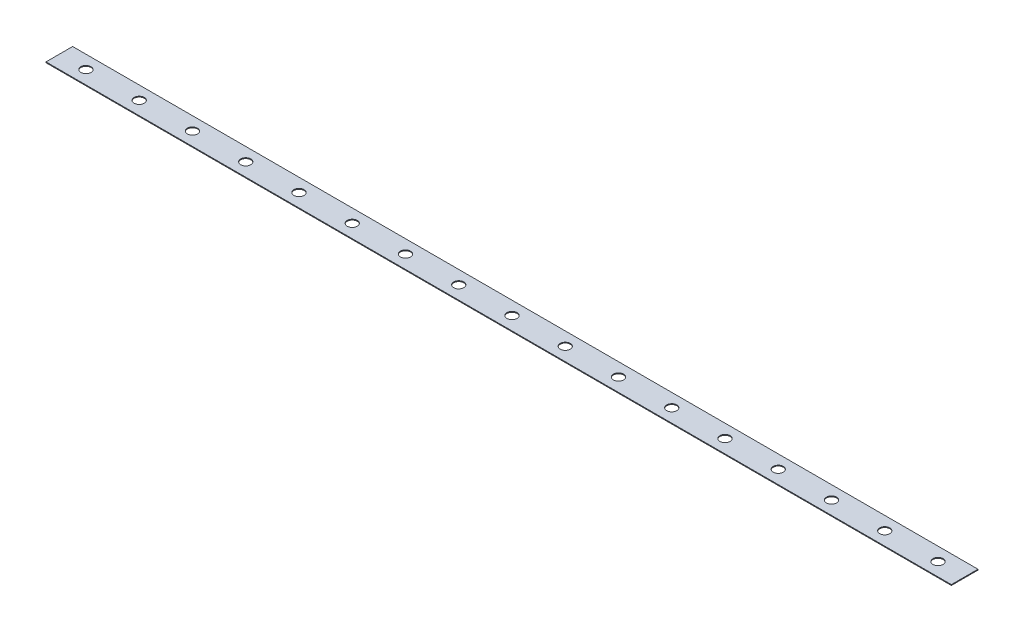
ISO-10303-21;
HEADER;
FILE_DESCRIPTION(('STEP AP214'),'2;1');
FILE_NAME('part.step','',(''),(''),'','','');
FILE_SCHEMA(('AUTOMOTIVE_DESIGN { 1 0 10303 214 1 1 1 1 }'));
ENDSEC;
DATA;
#1=APPLICATION_CONTEXT('core data for automotive mechanical design processes');
#2=APPLICATION_PROTOCOL_DEFINITION('international standard','automotive_design',2000,#1);
#3=PRODUCT_CONTEXT('',#1,'mechanical');
#4=PRODUCT('Part','Part','',(#3));
#5=PRODUCT_RELATED_PRODUCT_CATEGORY('part','',(#4));
#6=PRODUCT_DEFINITION_FORMATION('','',#4);
#7=PRODUCT_DEFINITION_CONTEXT('part definition',#1,'design');
#8=PRODUCT_DEFINITION('design','',#6,#7);
#9=PRODUCT_DEFINITION_SHAPE('','',#8);
#10=(LENGTH_UNIT() NAMED_UNIT(*) SI_UNIT(.MILLI.,.METRE.));
#11=(NAMED_UNIT(*) PLANE_ANGLE_UNIT() SI_UNIT($,.RADIAN.));
#12=(NAMED_UNIT(*) SI_UNIT($,.STERADIAN.) SOLID_ANGLE_UNIT());
#13=UNCERTAINTY_MEASURE_WITH_UNIT(LENGTH_MEASURE(1.E-05),#10,'distance_accuracy_value','');
#14=(GEOMETRIC_REPRESENTATION_CONTEXT(3) GLOBAL_UNCERTAINTY_ASSIGNED_CONTEXT((#13)) GLOBAL_UNIT_ASSIGNED_CONTEXT((#10,
#11,#12)) REPRESENTATION_CONTEXT('',''));
#15=CARTESIAN_POINT('',(0.,0.,0.));
#16=DIRECTION('',(0.,0.,1.));
#17=DIRECTION('',(1.,0.,0.));
#18=AXIS2_PLACEMENT_3D('',#15,#16,#17);
#19=CARTESIAN_POINT('',(215.9,0.381,-6.35));
#20=DIRECTION('',(-1.,0.,0.));
#21=DIRECTION('',(0.,0.,1.));
#22=AXIS2_PLACEMENT_3D('',#19,#20,#21);
#23=PLANE('',#22);
#24=DIRECTION('',(0.,0.,-1.));
#25=VECTOR('',#24,1.);
#26=CARTESIAN_POINT('',(215.9,0.,-6.35));
#27=LINE('',#26,#25);
#28=CARTESIAN_POINT('',(215.9,0.,6.35));
#29=VERTEX_POINT('',#28);
#30=CARTESIAN_POINT('',(215.9,0.,-6.35));
#31=VERTEX_POINT('',#30);
#32=EDGE_CURVE('E98',#29,#31,#27,.T.);
#33=ORIENTED_EDGE('',*,*,#32,.T.);
#34=DIRECTION('',(0.,-1.,0.));
#35=VECTOR('',#34,1.);
#36=CARTESIAN_POINT('',(215.9,0.381,-6.35));
#37=LINE('',#36,#35);
#38=CARTESIAN_POINT('',(215.9,0.381,-6.35));
#39=VERTEX_POINT('',#38);
#40=EDGE_CURVE('E11',#39,#31,#37,.T.);
#41=ORIENTED_EDGE('',*,*,#40,.F.);
#42=DIRECTION('',(0.,0.,-1.));
#43=VECTOR('',#42,1.);
#44=CARTESIAN_POINT('',(215.9,0.381,-6.35));
#45=LINE('',#44,#43);
#46=CARTESIAN_POINT('',(215.9,0.381,6.35));
#47=VERTEX_POINT('',#46);
#48=EDGE_CURVE('E86',#47,#39,#45,.T.);
#49=ORIENTED_EDGE('',*,*,#48,.F.);
#50=DIRECTION('',(0.,-1.,0.));
#51=VECTOR('',#50,1.);
#52=CARTESIAN_POINT('',(215.9,0.381,6.35));
#53=LINE('',#52,#51);
#54=EDGE_CURVE('E94',#47,#29,#53,.T.);
#55=ORIENTED_EDGE('',*,*,#54,.T.);
#56=EDGE_LOOP('',(#33,#41,#49,#55));
#57=FACE_BOUND('',#56,.T.);
#58=ADVANCED_FACE('F35',(#57),#23,.F.);
#59=CARTESIAN_POINT('',(-215.9,0.381,-6.35));
#60=DIRECTION('',(0.,0.,1.));
#61=DIRECTION('',(1.,0.,0.));
#62=AXIS2_PLACEMENT_3D('',#59,#60,#61);
#63=PLANE('',#62);
#64=DIRECTION('',(-1.,0.,0.));
#65=VECTOR('',#64,1.);
#66=CARTESIAN_POINT('',(-215.9,0.,-6.35));
#67=LINE('',#66,#65);
#68=CARTESIAN_POINT('',(-215.9,0.,-6.35));
#69=VERTEX_POINT('',#68);
#70=EDGE_CURVE('E90',#31,#69,#67,.T.);
#71=ORIENTED_EDGE('',*,*,#70,.T.);
#72=DIRECTION('',(0.,-1.,0.));
#73=VECTOR('',#72,1.);
#74=CARTESIAN_POINT('',(-215.9,0.381,-6.35));
#75=LINE('',#74,#73);
#76=CARTESIAN_POINT('',(-215.9,0.381,-6.35));
#77=VERTEX_POINT('',#76);
#78=EDGE_CURVE('E43',#77,#69,#75,.T.);
#79=ORIENTED_EDGE('',*,*,#78,.F.);
#80=DIRECTION('',(-1.,0.,0.));
#81=VECTOR('',#80,1.);
#82=CARTESIAN_POINT('',(-215.9,0.381,-6.35));
#83=LINE('',#82,#81);
#84=EDGE_CURVE('E81',#39,#77,#83,.T.);
#85=ORIENTED_EDGE('',*,*,#84,.F.);
#86=ORIENTED_EDGE('',*,*,#40,.T.);
#87=EDGE_LOOP('',(#71,#79,#85,#86));
#88=FACE_BOUND('',#87,.T.);
#89=ADVANCED_FACE('F89',(#88),#63,.F.);
#90=CARTESIAN_POINT('',(-215.9,0.381,-6.35));
#91=DIRECTION('',(1.,0.,0.));
#92=DIRECTION('',(0.,0.,-1.));
#93=AXIS2_PLACEMENT_3D('',#90,#91,#92);
#94=PLANE('',#93);
#95=DIRECTION('',(0.,0.,1.));
#96=VECTOR('',#95,1.);
#97=CARTESIAN_POINT('',(-215.9,0.,-6.35));
#98=LINE('',#97,#96);
#99=CARTESIAN_POINT('',(-215.9,0.,6.35));
#100=VERTEX_POINT('',#99);
#101=EDGE_CURVE('E68',#69,#100,#98,.T.);
#102=ORIENTED_EDGE('',*,*,#101,.T.);
#103=DIRECTION('',(0.,-1.,0.));
#104=VECTOR('',#103,1.);
#105=CARTESIAN_POINT('',(-215.9,0.381,6.35));
#106=LINE('',#105,#104);
#107=CARTESIAN_POINT('',(-215.9,0.381,6.35));
#108=VERTEX_POINT('',#107);
#109=EDGE_CURVE('E91',#108,#100,#106,.T.);
#110=ORIENTED_EDGE('',*,*,#109,.F.);
#111=DIRECTION('',(0.,0.,1.));
#112=VECTOR('',#111,1.);
#113=CARTESIAN_POINT('',(-215.9,0.381,-6.35));
#114=LINE('',#113,#112);
#115=EDGE_CURVE('E84',#77,#108,#114,.T.);
#116=ORIENTED_EDGE('',*,*,#115,.F.);
#117=ORIENTED_EDGE('',*,*,#78,.T.);
#118=EDGE_LOOP('',(#102,#110,#116,#117));
#119=FACE_BOUND('',#118,.T.);
#120=ADVANCED_FACE('F92',(#119),#94,.F.);
#121=CARTESIAN_POINT('',(-215.9,0.381,6.35));
#122=DIRECTION('',(0.,0.,-1.));
#123=DIRECTION('',(-1.,0.,0.));
#124=AXIS2_PLACEMENT_3D('',#121,#122,#123);
#125=PLANE('',#124);
#126=DIRECTION('',(1.,0.,0.));
#127=VECTOR('',#126,1.);
#128=CARTESIAN_POINT('',(-215.9,0.,6.35));
#129=LINE('',#128,#127);
#130=EDGE_CURVE('E74',#100,#29,#129,.T.);
#131=ORIENTED_EDGE('',*,*,#130,.T.);
#132=ORIENTED_EDGE('',*,*,#54,.F.);
#133=DIRECTION('',(1.,0.,0.));
#134=VECTOR('',#133,1.);
#135=CARTESIAN_POINT('',(-215.9,0.381,6.35));
#136=LINE('',#135,#134);
#137=EDGE_CURVE('E51',#108,#47,#136,.T.);
#138=ORIENTED_EDGE('',*,*,#137,.F.);
#139=ORIENTED_EDGE('',*,*,#109,.T.);
#140=EDGE_LOOP('',(#131,#132,#138,#139));
#141=FACE_BOUND('',#140,.T.);
#142=ADVANCED_FACE('F106',(#141),#125,.F.);
#143=CARTESIAN_POINT('',(0.,0.381,0.));
#144=DIRECTION('',(0.,1.,0.));
#145=DIRECTION('',(0.,0.,1.));
#146=AXIS2_PLACEMENT_3D('',#143,#144,#145);
#147=PLANE('',#146);
#148=CARTESIAN_POINT('',(203.2,0.381,0.));
#149=DIRECTION('',(0.,1.,0.));
#150=DIRECTION('',(0.,0.,1.));
#151=AXIS2_PLACEMENT_3D('',#148,#149,#150);
#152=CIRCLE('',#151,2.413);
#153=CARTESIAN_POINT('',(203.2,0.381,2.413));
#154=VERTEX_POINT('',#153);
#155=EDGE_CURVE('E208',#154,#154,#152,.T.);
#156=ORIENTED_EDGE('',*,*,#155,.F.);
#157=EDGE_LOOP('',(#156));
#158=FACE_BOUND('',#157,.T.);
#159=CARTESIAN_POINT('',(177.8,0.381,0.));
#160=DIRECTION('',(0.,1.,0.));
#161=DIRECTION('',(0.,0.,1.));
#162=AXIS2_PLACEMENT_3D('',#159,#160,#161);
#163=CIRCLE('',#162,2.413);
#164=CARTESIAN_POINT('',(177.8,0.381,2.413));
#165=VERTEX_POINT('',#164);
#166=EDGE_CURVE('E202',#165,#165,#163,.T.);
#167=ORIENTED_EDGE('',*,*,#166,.F.);
#168=EDGE_LOOP('',(#167));
#169=FACE_BOUND('',#168,.T.);
#170=CARTESIAN_POINT('',(152.4,0.381,0.));
#171=DIRECTION('',(0.,1.,0.));
#172=DIRECTION('',(0.,0.,1.));
#173=AXIS2_PLACEMENT_3D('',#170,#171,#172);
#174=CIRCLE('',#173,2.413);
#175=CARTESIAN_POINT('',(152.4,0.381,2.413));
#176=VERTEX_POINT('',#175);
#177=EDGE_CURVE('E196',#176,#176,#174,.T.);
#178=ORIENTED_EDGE('',*,*,#177,.F.);
#179=EDGE_LOOP('',(#178));
#180=FACE_BOUND('',#179,.T.);
#181=CARTESIAN_POINT('',(127.,0.381,0.));
#182=DIRECTION('',(0.,1.,0.));
#183=DIRECTION('',(0.,0.,1.));
#184=AXIS2_PLACEMENT_3D('',#181,#182,#183);
#185=CIRCLE('',#184,2.413);
#186=CARTESIAN_POINT('',(127.,0.381,2.413));
#187=VERTEX_POINT('',#186);
#188=EDGE_CURVE('E190',#187,#187,#185,.T.);
#189=ORIENTED_EDGE('',*,*,#188,.F.);
#190=EDGE_LOOP('',(#189));
#191=FACE_BOUND('',#190,.T.);
#192=CARTESIAN_POINT('',(101.6,0.381,0.));
#193=DIRECTION('',(0.,1.,0.));
#194=DIRECTION('',(0.,0.,1.));
#195=AXIS2_PLACEMENT_3D('',#192,#193,#194);
#196=CIRCLE('',#195,2.413);
#197=CARTESIAN_POINT('',(101.6,0.381,2.413));
#198=VERTEX_POINT('',#197);
#199=EDGE_CURVE('E184',#198,#198,#196,.T.);
#200=ORIENTED_EDGE('',*,*,#199,.F.);
#201=EDGE_LOOP('',(#200));
#202=FACE_BOUND('',#201,.T.);
#203=CARTESIAN_POINT('',(76.2,0.381,0.));
#204=DIRECTION('',(0.,1.,0.));
#205=DIRECTION('',(0.,0.,1.));
#206=AXIS2_PLACEMENT_3D('',#203,#204,#205);
#207=CIRCLE('',#206,2.413);
#208=CARTESIAN_POINT('',(76.2,0.381,2.413));
#209=VERTEX_POINT('',#208);
#210=EDGE_CURVE('E178',#209,#209,#207,.T.);
#211=ORIENTED_EDGE('',*,*,#210,.F.);
#212=EDGE_LOOP('',(#211));
#213=FACE_BOUND('',#212,.T.);
#214=CARTESIAN_POINT('',(50.8,0.381,0.));
#215=DIRECTION('',(0.,1.,0.));
#216=DIRECTION('',(0.,0.,1.));
#217=AXIS2_PLACEMENT_3D('',#214,#215,#216);
#218=CIRCLE('',#217,2.413);
#219=CARTESIAN_POINT('',(50.8,0.381,2.413));
#220=VERTEX_POINT('',#219);
#221=EDGE_CURVE('E172',#220,#220,#218,.T.);
#222=ORIENTED_EDGE('',*,*,#221,.F.);
#223=EDGE_LOOP('',(#222));
#224=FACE_BOUND('',#223,.T.);
#225=CARTESIAN_POINT('',(-203.2,0.381,1.24157076409262E-12));
#226=DIRECTION('',(0.,1.,0.));
#227=DIRECTION('',(0.,0.,1.));
#228=AXIS2_PLACEMENT_3D('',#225,#226,#227);
#229=CIRCLE('',#228,2.413);
#230=CARTESIAN_POINT('',(-203.2,0.381,2.41300000000124));
#231=VERTEX_POINT('',#230);
#232=EDGE_CURVE('E166',#231,#231,#229,.T.);
#233=ORIENTED_EDGE('',*,*,#232,.F.);
#234=EDGE_LOOP('',(#233));
#235=FACE_BOUND('',#234,.T.);
#236=CARTESIAN_POINT('',(-177.8,0.381,1.06420351207939E-12));
#237=DIRECTION('',(0.,1.,0.));
#238=DIRECTION('',(0.,0.,1.));
#239=AXIS2_PLACEMENT_3D('',#236,#237,#238);
#240=CIRCLE('',#239,2.413);
#241=CARTESIAN_POINT('',(-177.8,0.381,2.41300000000106));
#242=VERTEX_POINT('',#241);
#243=EDGE_CURVE('E160',#242,#242,#240,.T.);
#244=ORIENTED_EDGE('',*,*,#243,.F.);
#245=EDGE_LOOP('',(#244));
#246=FACE_BOUND('',#245,.T.);
#247=CARTESIAN_POINT('',(-152.4,0.381,8.86836260066156E-13));
#248=DIRECTION('',(0.,1.,0.));
#249=DIRECTION('',(0.,0.,1.));
#250=AXIS2_PLACEMENT_3D('',#247,#248,#249);
#251=CIRCLE('',#250,2.413);
#252=CARTESIAN_POINT('',(-152.4,0.381,2.41300000000088));
#253=VERTEX_POINT('',#252);
#254=EDGE_CURVE('E154',#253,#253,#251,.T.);
#255=ORIENTED_EDGE('',*,*,#254,.F.);
#256=EDGE_LOOP('',(#255));
#257=FACE_BOUND('',#256,.T.);
#258=CARTESIAN_POINT('',(-127.,0.381,7.09469008052925E-13));
#259=DIRECTION('',(0.,1.,0.));
#260=DIRECTION('',(0.,0.,1.));
#261=AXIS2_PLACEMENT_3D('',#258,#259,#260);
#262=CIRCLE('',#261,2.413);
#263=CARTESIAN_POINT('',(-127.,0.381,2.41300000000071));
#264=VERTEX_POINT('',#263);
#265=EDGE_CURVE('E148',#264,#264,#262,.T.);
#266=ORIENTED_EDGE('',*,*,#265,.F.);
#267=EDGE_LOOP('',(#266));
#268=FACE_BOUND('',#267,.T.);
#269=CARTESIAN_POINT('',(-101.6,0.381,5.32101756039693E-13));
#270=DIRECTION('',(0.,1.,0.));
#271=DIRECTION('',(0.,0.,1.));
#272=AXIS2_PLACEMENT_3D('',#269,#270,#271);
#273=CIRCLE('',#272,2.413);
#274=CARTESIAN_POINT('',(-101.6,0.381,2.41300000000053));
#275=VERTEX_POINT('',#274);
#276=EDGE_CURVE('E142',#275,#275,#273,.T.);
#277=ORIENTED_EDGE('',*,*,#276,.F.);
#278=EDGE_LOOP('',(#277));
#279=FACE_BOUND('',#278,.T.);
#280=CARTESIAN_POINT('',(-76.2,0.381,3.54734504026462E-13));
#281=DIRECTION('',(0.,1.,0.));
#282=DIRECTION('',(0.,0.,1.));
#283=AXIS2_PLACEMENT_3D('',#280,#281,#282);
#284=CIRCLE('',#283,2.413);
#285=CARTESIAN_POINT('',(-76.2,0.381,2.41300000000035));
#286=VERTEX_POINT('',#285);
#287=EDGE_CURVE('E136',#286,#286,#284,.T.);
#288=ORIENTED_EDGE('',*,*,#287,.F.);
#289=EDGE_LOOP('',(#288));
#290=FACE_BOUND('',#289,.T.);
#291=CARTESIAN_POINT('',(-50.8,0.381,1.77367252013231E-13));
#292=DIRECTION('',(0.,1.,0.));
#293=DIRECTION('',(0.,0.,1.));
#294=AXIS2_PLACEMENT_3D('',#291,#292,#293);
#295=CIRCLE('',#294,2.413);
#296=CARTESIAN_POINT('',(-50.8,0.381,2.41300000000017));
#297=VERTEX_POINT('',#296);
#298=EDGE_CURVE('E130',#297,#297,#295,.T.);
#299=ORIENTED_EDGE('',*,*,#298,.F.);
#300=EDGE_LOOP('',(#299));
#301=FACE_BOUND('',#300,.T.);
#302=CARTESIAN_POINT('',(25.4,0.381,0.));
#303=DIRECTION('',(0.,1.,0.));
#304=DIRECTION('',(0.,0.,1.));
#305=AXIS2_PLACEMENT_3D('',#302,#303,#304);
#306=CIRCLE('',#305,2.413);
#307=CARTESIAN_POINT('',(25.4,0.381,2.413));
#308=VERTEX_POINT('',#307);
#309=EDGE_CURVE('E124',#308,#308,#306,.T.);
#310=ORIENTED_EDGE('',*,*,#309,.F.);
#311=EDGE_LOOP('',(#310));
#312=FACE_BOUND('',#311,.T.);
#313=CARTESIAN_POINT('',(-25.4,0.381,0.));
#314=DIRECTION('',(0.,1.,0.));
#315=DIRECTION('',(0.,0.,1.));
#316=AXIS2_PLACEMENT_3D('',#313,#314,#315);
#317=CIRCLE('',#316,2.413);
#318=CARTESIAN_POINT('',(-25.4,0.381,2.413));
#319=VERTEX_POINT('',#318);
#320=EDGE_CURVE('E118',#319,#319,#317,.T.);
#321=ORIENTED_EDGE('',*,*,#320,.F.);
#322=EDGE_LOOP('',(#321));
#323=FACE_BOUND('',#322,.T.);
#324=CARTESIAN_POINT('',(0.,0.381,0.));
#325=DIRECTION('',(0.,1.,0.));
#326=DIRECTION('',(0.,0.,1.));
#327=AXIS2_PLACEMENT_3D('',#324,#325,#326);
#328=CIRCLE('',#327,2.413);
#329=CARTESIAN_POINT('',(0.,0.381,2.413));
#330=VERTEX_POINT('',#329);
#331=EDGE_CURVE('E112',#330,#330,#328,.T.);
#332=ORIENTED_EDGE('',*,*,#331,.F.);
#333=EDGE_LOOP('',(#332));
#334=FACE_BOUND('',#333,.T.);
#335=ORIENTED_EDGE('',*,*,#48,.T.);
#336=ORIENTED_EDGE('',*,*,#84,.T.);
#337=ORIENTED_EDGE('',*,*,#115,.T.);
#338=ORIENTED_EDGE('',*,*,#137,.T.);
#339=EDGE_LOOP('',(#335,#336,#337,#338));
#340=FACE_BOUND('',#339,.T.);
#341=ADVANCED_FACE('F82',(#158,#169,#180,#191,#202,#213,#224,#235,#246,#257,#268,#279,#290,#301,
#312,#323,#334,#340),#147,.T.);
#342=CARTESIAN_POINT('',(0.,0.,0.));
#343=DIRECTION('',(0.,1.,0.));
#344=DIRECTION('',(0.,0.,1.));
#345=AXIS2_PLACEMENT_3D('',#342,#343,#344);
#346=PLANE('',#345);
#347=CARTESIAN_POINT('',(203.2,0.,0.));
#348=DIRECTION('',(0.,1.,0.));
#349=DIRECTION('',(0.,0.,1.));
#350=AXIS2_PLACEMENT_3D('',#347,#348,#349);
#351=CIRCLE('',#350,2.413);
#352=CARTESIAN_POINT('',(203.2,0.,2.413));
#353=VERTEX_POINT('',#352);
#354=EDGE_CURVE('E205',#353,#353,#351,.T.);
#355=ORIENTED_EDGE('',*,*,#354,.T.);
#356=EDGE_LOOP('',(#355));
#357=FACE_BOUND('',#356,.T.);
#358=CARTESIAN_POINT('',(177.8,0.,0.));
#359=DIRECTION('',(0.,1.,0.));
#360=DIRECTION('',(0.,0.,1.));
#361=AXIS2_PLACEMENT_3D('',#358,#359,#360);
#362=CIRCLE('',#361,2.413);
#363=CARTESIAN_POINT('',(177.8,0.,2.413));
#364=VERTEX_POINT('',#363);
#365=EDGE_CURVE('E199',#364,#364,#362,.T.);
#366=ORIENTED_EDGE('',*,*,#365,.T.);
#367=EDGE_LOOP('',(#366));
#368=FACE_BOUND('',#367,.T.);
#369=CARTESIAN_POINT('',(152.4,0.,0.));
#370=DIRECTION('',(0.,1.,0.));
#371=DIRECTION('',(0.,0.,1.));
#372=AXIS2_PLACEMENT_3D('',#369,#370,#371);
#373=CIRCLE('',#372,2.413);
#374=CARTESIAN_POINT('',(152.4,0.,2.413));
#375=VERTEX_POINT('',#374);
#376=EDGE_CURVE('E193',#375,#375,#373,.T.);
#377=ORIENTED_EDGE('',*,*,#376,.T.);
#378=EDGE_LOOP('',(#377));
#379=FACE_BOUND('',#378,.T.);
#380=CARTESIAN_POINT('',(127.,0.,0.));
#381=DIRECTION('',(0.,1.,0.));
#382=DIRECTION('',(0.,0.,1.));
#383=AXIS2_PLACEMENT_3D('',#380,#381,#382);
#384=CIRCLE('',#383,2.413);
#385=CARTESIAN_POINT('',(127.,0.,2.413));
#386=VERTEX_POINT('',#385);
#387=EDGE_CURVE('E187',#386,#386,#384,.T.);
#388=ORIENTED_EDGE('',*,*,#387,.T.);
#389=EDGE_LOOP('',(#388));
#390=FACE_BOUND('',#389,.T.);
#391=CARTESIAN_POINT('',(101.6,0.,0.));
#392=DIRECTION('',(0.,1.,0.));
#393=DIRECTION('',(0.,0.,1.));
#394=AXIS2_PLACEMENT_3D('',#391,#392,#393);
#395=CIRCLE('',#394,2.413);
#396=CARTESIAN_POINT('',(101.6,0.,2.413));
#397=VERTEX_POINT('',#396);
#398=EDGE_CURVE('E181',#397,#397,#395,.T.);
#399=ORIENTED_EDGE('',*,*,#398,.T.);
#400=EDGE_LOOP('',(#399));
#401=FACE_BOUND('',#400,.T.);
#402=CARTESIAN_POINT('',(76.2,0.,0.));
#403=DIRECTION('',(0.,1.,0.));
#404=DIRECTION('',(0.,0.,1.));
#405=AXIS2_PLACEMENT_3D('',#402,#403,#404);
#406=CIRCLE('',#405,2.413);
#407=CARTESIAN_POINT('',(76.2,0.,2.413));
#408=VERTEX_POINT('',#407);
#409=EDGE_CURVE('E175',#408,#408,#406,.T.);
#410=ORIENTED_EDGE('',*,*,#409,.T.);
#411=EDGE_LOOP('',(#410));
#412=FACE_BOUND('',#411,.T.);
#413=CARTESIAN_POINT('',(50.8,0.,0.));
#414=DIRECTION('',(0.,1.,0.));
#415=DIRECTION('',(0.,0.,1.));
#416=AXIS2_PLACEMENT_3D('',#413,#414,#415);
#417=CIRCLE('',#416,2.413);
#418=CARTESIAN_POINT('',(50.8,0.,2.413));
#419=VERTEX_POINT('',#418);
#420=EDGE_CURVE('E169',#419,#419,#417,.T.);
#421=ORIENTED_EDGE('',*,*,#420,.T.);
#422=EDGE_LOOP('',(#421));
#423=FACE_BOUND('',#422,.T.);
#424=CARTESIAN_POINT('',(-203.2,0.,1.24157076409262E-12));
#425=DIRECTION('',(0.,1.,0.));
#426=DIRECTION('',(0.,0.,1.));
#427=AXIS2_PLACEMENT_3D('',#424,#425,#426);
#428=CIRCLE('',#427,2.413);
#429=CARTESIAN_POINT('',(-203.2,0.,2.41300000000124));
#430=VERTEX_POINT('',#429);
#431=EDGE_CURVE('E163',#430,#430,#428,.T.);
#432=ORIENTED_EDGE('',*,*,#431,.T.);
#433=EDGE_LOOP('',(#432));
#434=FACE_BOUND('',#433,.T.);
#435=CARTESIAN_POINT('',(-177.8,0.,1.06420351207939E-12));
#436=DIRECTION('',(0.,1.,0.));
#437=DIRECTION('',(0.,0.,1.));
#438=AXIS2_PLACEMENT_3D('',#435,#436,#437);
#439=CIRCLE('',#438,2.413);
#440=CARTESIAN_POINT('',(-177.8,0.,2.41300000000106));
#441=VERTEX_POINT('',#440);
#442=EDGE_CURVE('E157',#441,#441,#439,.T.);
#443=ORIENTED_EDGE('',*,*,#442,.T.);
#444=EDGE_LOOP('',(#443));
#445=FACE_BOUND('',#444,.T.);
#446=CARTESIAN_POINT('',(-152.4,0.,8.86836260066156E-13));
#447=DIRECTION('',(0.,1.,0.));
#448=DIRECTION('',(0.,0.,1.));
#449=AXIS2_PLACEMENT_3D('',#446,#447,#448);
#450=CIRCLE('',#449,2.413);
#451=CARTESIAN_POINT('',(-152.4,0.,2.41300000000088));
#452=VERTEX_POINT('',#451);
#453=EDGE_CURVE('E151',#452,#452,#450,.T.);
#454=ORIENTED_EDGE('',*,*,#453,.T.);
#455=EDGE_LOOP('',(#454));
#456=FACE_BOUND('',#455,.T.);
#457=CARTESIAN_POINT('',(-127.,0.,7.09469008052925E-13));
#458=DIRECTION('',(0.,1.,0.));
#459=DIRECTION('',(0.,0.,1.));
#460=AXIS2_PLACEMENT_3D('',#457,#458,#459);
#461=CIRCLE('',#460,2.413);
#462=CARTESIAN_POINT('',(-127.,0.,2.41300000000071));
#463=VERTEX_POINT('',#462);
#464=EDGE_CURVE('E145',#463,#463,#461,.T.);
#465=ORIENTED_EDGE('',*,*,#464,.T.);
#466=EDGE_LOOP('',(#465));
#467=FACE_BOUND('',#466,.T.);
#468=CARTESIAN_POINT('',(-101.6,0.,5.32101756039693E-13));
#469=DIRECTION('',(0.,1.,0.));
#470=DIRECTION('',(0.,0.,1.));
#471=AXIS2_PLACEMENT_3D('',#468,#469,#470);
#472=CIRCLE('',#471,2.413);
#473=CARTESIAN_POINT('',(-101.6,0.,2.41300000000053));
#474=VERTEX_POINT('',#473);
#475=EDGE_CURVE('E139',#474,#474,#472,.T.);
#476=ORIENTED_EDGE('',*,*,#475,.T.);
#477=EDGE_LOOP('',(#476));
#478=FACE_BOUND('',#477,.T.);
#479=CARTESIAN_POINT('',(-76.2,0.,3.54734504026462E-13));
#480=DIRECTION('',(0.,1.,0.));
#481=DIRECTION('',(0.,0.,1.));
#482=AXIS2_PLACEMENT_3D('',#479,#480,#481);
#483=CIRCLE('',#482,2.413);
#484=CARTESIAN_POINT('',(-76.2,0.,2.41300000000035));
#485=VERTEX_POINT('',#484);
#486=EDGE_CURVE('E133',#485,#485,#483,.T.);
#487=ORIENTED_EDGE('',*,*,#486,.T.);
#488=EDGE_LOOP('',(#487));
#489=FACE_BOUND('',#488,.T.);
#490=CARTESIAN_POINT('',(-50.8,0.,1.77367252013231E-13));
#491=DIRECTION('',(0.,1.,0.));
#492=DIRECTION('',(0.,0.,1.));
#493=AXIS2_PLACEMENT_3D('',#490,#491,#492);
#494=CIRCLE('',#493,2.413);
#495=CARTESIAN_POINT('',(-50.8,0.,2.41300000000017));
#496=VERTEX_POINT('',#495);
#497=EDGE_CURVE('E127',#496,#496,#494,.T.);
#498=ORIENTED_EDGE('',*,*,#497,.T.);
#499=EDGE_LOOP('',(#498));
#500=FACE_BOUND('',#499,.T.);
#501=CARTESIAN_POINT('',(25.4,0.,0.));
#502=DIRECTION('',(0.,1.,0.));
#503=DIRECTION('',(0.,0.,1.));
#504=AXIS2_PLACEMENT_3D('',#501,#502,#503);
#505=CIRCLE('',#504,2.413);
#506=CARTESIAN_POINT('',(25.4,0.,2.413));
#507=VERTEX_POINT('',#506);
#508=EDGE_CURVE('E121',#507,#507,#505,.T.);
#509=ORIENTED_EDGE('',*,*,#508,.T.);
#510=EDGE_LOOP('',(#509));
#511=FACE_BOUND('',#510,.T.);
#512=CARTESIAN_POINT('',(-25.4,0.,0.));
#513=DIRECTION('',(0.,1.,0.));
#514=DIRECTION('',(0.,0.,1.));
#515=AXIS2_PLACEMENT_3D('',#512,#513,#514);
#516=CIRCLE('',#515,2.413);
#517=CARTESIAN_POINT('',(-25.4,0.,2.413));
#518=VERTEX_POINT('',#517);
#519=EDGE_CURVE('E115',#518,#518,#516,.T.);
#520=ORIENTED_EDGE('',*,*,#519,.T.);
#521=EDGE_LOOP('',(#520));
#522=FACE_BOUND('',#521,.T.);
#523=CARTESIAN_POINT('',(0.,0.,0.));
#524=DIRECTION('',(0.,1.,0.));
#525=DIRECTION('',(0.,0.,1.));
#526=AXIS2_PLACEMENT_3D('',#523,#524,#525);
#527=CIRCLE('',#526,2.413);
#528=CARTESIAN_POINT('',(0.,0.,2.413));
#529=VERTEX_POINT('',#528);
#530=EDGE_CURVE('E101',#529,#529,#527,.T.);
#531=ORIENTED_EDGE('',*,*,#530,.T.);
#532=EDGE_LOOP('',(#531));
#533=FACE_BOUND('',#532,.T.);
#534=ORIENTED_EDGE('',*,*,#32,.F.);
#535=ORIENTED_EDGE('',*,*,#130,.F.);
#536=ORIENTED_EDGE('',*,*,#101,.F.);
#537=ORIENTED_EDGE('',*,*,#70,.F.);
#538=EDGE_LOOP('',(#534,#535,#536,#537));
#539=FACE_BOUND('',#538,.T.);
#540=ADVANCED_FACE('F109',(#357,#368,#379,#390,#401,#412,#423,#434,#445,#456,#467,#478,#489,
#500,#511,#522,#533,#539),#346,.F.);
#541=CARTESIAN_POINT('',(0.,0.,0.));
#542=DIRECTION('',(0.,1.,0.));
#543=DIRECTION('',(0.,0.,1.));
#544=AXIS2_PLACEMENT_3D('',#541,#542,#543);
#545=CYLINDRICAL_SURFACE('',#544,2.413);
#546=ORIENTED_EDGE('',*,*,#530,.F.);
#547=EDGE_LOOP('',(#546));
#548=FACE_BOUND('',#547,.T.);
#549=ORIENTED_EDGE('',*,*,#331,.T.);
#550=EDGE_LOOP('',(#549));
#551=FACE_BOUND('',#550,.T.);
#552=ADVANCED_FACE('F258',(#548,#551),#545,.F.);
#553=CARTESIAN_POINT('',(-25.4,0.,0.));
#554=DIRECTION('',(0.,1.,0.));
#555=DIRECTION('',(0.,0.,1.));
#556=AXIS2_PLACEMENT_3D('',#553,#554,#555);
#557=CYLINDRICAL_SURFACE('',#556,2.413);
#558=ORIENTED_EDGE('',*,*,#519,.F.);
#559=EDGE_LOOP('',(#558));
#560=FACE_BOUND('',#559,.T.);
#561=ORIENTED_EDGE('',*,*,#320,.T.);
#562=EDGE_LOOP('',(#561));
#563=FACE_BOUND('',#562,.T.);
#564=ADVANCED_FACE('F260',(#560,#563),#557,.F.);
#565=CARTESIAN_POINT('',(25.4,0.,0.));
#566=DIRECTION('',(0.,1.,0.));
#567=DIRECTION('',(0.,0.,1.));
#568=AXIS2_PLACEMENT_3D('',#565,#566,#567);
#569=CYLINDRICAL_SURFACE('',#568,2.413);
#570=ORIENTED_EDGE('',*,*,#508,.F.);
#571=EDGE_LOOP('',(#570));
#572=FACE_BOUND('',#571,.T.);
#573=ORIENTED_EDGE('',*,*,#309,.T.);
#574=EDGE_LOOP('',(#573));
#575=FACE_BOUND('',#574,.T.);
#576=ADVANCED_FACE('F267',(#572,#575),#569,.F.);
#577=CARTESIAN_POINT('',(-50.8,0.,1.77367252013231E-13));
#578=DIRECTION('',(0.,1.,0.));
#579=DIRECTION('',(0.,0.,1.));
#580=AXIS2_PLACEMENT_3D('',#577,#578,#579);
#581=CYLINDRICAL_SURFACE('',#580,2.413);
#582=ORIENTED_EDGE('',*,*,#497,.F.);
#583=EDGE_LOOP('',(#582));
#584=FACE_BOUND('',#583,.T.);
#585=ORIENTED_EDGE('',*,*,#298,.T.);
#586=EDGE_LOOP('',(#585));
#587=FACE_BOUND('',#586,.T.);
#588=ADVANCED_FACE('F313',(#584,#587),#581,.F.);
#589=CARTESIAN_POINT('',(-76.2,0.,3.54734504026462E-13));
#590=DIRECTION('',(0.,1.,0.));
#591=DIRECTION('',(0.,0.,1.));
#592=AXIS2_PLACEMENT_3D('',#589,#590,#591);
#593=CYLINDRICAL_SURFACE('',#592,2.413);
#594=ORIENTED_EDGE('',*,*,#486,.F.);
#595=EDGE_LOOP('',(#594));
#596=FACE_BOUND('',#595,.T.);
#597=ORIENTED_EDGE('',*,*,#287,.T.);
#598=EDGE_LOOP('',(#597));
#599=FACE_BOUND('',#598,.T.);
#600=ADVANCED_FACE('F323',(#596,#599),#593,.F.);
#601=CARTESIAN_POINT('',(-101.6,0.,5.32101756039693E-13));
#602=DIRECTION('',(0.,1.,0.));
#603=DIRECTION('',(0.,0.,1.));
#604=AXIS2_PLACEMENT_3D('',#601,#602,#603);
#605=CYLINDRICAL_SURFACE('',#604,2.413);
#606=ORIENTED_EDGE('',*,*,#475,.F.);
#607=EDGE_LOOP('',(#606));
#608=FACE_BOUND('',#607,.T.);
#609=ORIENTED_EDGE('',*,*,#276,.T.);
#610=EDGE_LOOP('',(#609));
#611=FACE_BOUND('',#610,.T.);
#612=ADVANCED_FACE('F333',(#608,#611),#605,.F.);
#613=CARTESIAN_POINT('',(-127.,0.,7.09469008052925E-13));
#614=DIRECTION('',(0.,1.,0.));
#615=DIRECTION('',(0.,0.,1.));
#616=AXIS2_PLACEMENT_3D('',#613,#614,#615);
#617=CYLINDRICAL_SURFACE('',#616,2.413);
#618=ORIENTED_EDGE('',*,*,#464,.F.);
#619=EDGE_LOOP('',(#618));
#620=FACE_BOUND('',#619,.T.);
#621=ORIENTED_EDGE('',*,*,#265,.T.);
#622=EDGE_LOOP('',(#621));
#623=FACE_BOUND('',#622,.T.);
#624=ADVANCED_FACE('F343',(#620,#623),#617,.F.);
#625=CARTESIAN_POINT('',(-152.4,0.,8.86836260066156E-13));
#626=DIRECTION('',(0.,1.,0.));
#627=DIRECTION('',(0.,0.,1.));
#628=AXIS2_PLACEMENT_3D('',#625,#626,#627);
#629=CYLINDRICAL_SURFACE('',#628,2.413);
#630=ORIENTED_EDGE('',*,*,#453,.F.);
#631=EDGE_LOOP('',(#630));
#632=FACE_BOUND('',#631,.T.);
#633=ORIENTED_EDGE('',*,*,#254,.T.);
#634=EDGE_LOOP('',(#633));
#635=FACE_BOUND('',#634,.T.);
#636=ADVANCED_FACE('F353',(#632,#635),#629,.F.);
#637=CARTESIAN_POINT('',(-177.8,0.,1.06420351207939E-12));
#638=DIRECTION('',(0.,1.,0.));
#639=DIRECTION('',(0.,0.,1.));
#640=AXIS2_PLACEMENT_3D('',#637,#638,#639);
#641=CYLINDRICAL_SURFACE('',#640,2.413);
#642=ORIENTED_EDGE('',*,*,#442,.F.);
#643=EDGE_LOOP('',(#642));
#644=FACE_BOUND('',#643,.T.);
#645=ORIENTED_EDGE('',*,*,#243,.T.);
#646=EDGE_LOOP('',(#645));
#647=FACE_BOUND('',#646,.T.);
#648=ADVANCED_FACE('F363',(#644,#647),#641,.F.);
#649=CARTESIAN_POINT('',(-203.2,0.,1.24157076409262E-12));
#650=DIRECTION('',(0.,1.,0.));
#651=DIRECTION('',(0.,0.,1.));
#652=AXIS2_PLACEMENT_3D('',#649,#650,#651);
#653=CYLINDRICAL_SURFACE('',#652,2.413);
#654=ORIENTED_EDGE('',*,*,#431,.F.);
#655=EDGE_LOOP('',(#654));
#656=FACE_BOUND('',#655,.T.);
#657=ORIENTED_EDGE('',*,*,#232,.T.);
#658=EDGE_LOOP('',(#657));
#659=FACE_BOUND('',#658,.T.);
#660=ADVANCED_FACE('F373',(#656,#659),#653,.F.);
#661=CARTESIAN_POINT('',(50.8,0.,0.));
#662=DIRECTION('',(0.,1.,0.));
#663=DIRECTION('',(0.,0.,1.));
#664=AXIS2_PLACEMENT_3D('',#661,#662,#663);
#665=CYLINDRICAL_SURFACE('',#664,2.413);
#666=ORIENTED_EDGE('',*,*,#420,.F.);
#667=EDGE_LOOP('',(#666));
#668=FACE_BOUND('',#667,.T.);
#669=ORIENTED_EDGE('',*,*,#221,.T.);
#670=EDGE_LOOP('',(#669));
#671=FACE_BOUND('',#670,.T.);
#672=ADVANCED_FACE('F383',(#668,#671),#665,.F.);
#673=CARTESIAN_POINT('',(76.2,0.,0.));
#674=DIRECTION('',(0.,1.,0.));
#675=DIRECTION('',(0.,0.,1.));
#676=AXIS2_PLACEMENT_3D('',#673,#674,#675);
#677=CYLINDRICAL_SURFACE('',#676,2.413);
#678=ORIENTED_EDGE('',*,*,#409,.F.);
#679=EDGE_LOOP('',(#678));
#680=FACE_BOUND('',#679,.T.);
#681=ORIENTED_EDGE('',*,*,#210,.T.);
#682=EDGE_LOOP('',(#681));
#683=FACE_BOUND('',#682,.T.);
#684=ADVANCED_FACE('F393',(#680,#683),#677,.F.);
#685=CARTESIAN_POINT('',(101.6,0.,0.));
#686=DIRECTION('',(0.,1.,0.));
#687=DIRECTION('',(0.,0.,1.));
#688=AXIS2_PLACEMENT_3D('',#685,#686,#687);
#689=CYLINDRICAL_SURFACE('',#688,2.413);
#690=ORIENTED_EDGE('',*,*,#398,.F.);
#691=EDGE_LOOP('',(#690));
#692=FACE_BOUND('',#691,.T.);
#693=ORIENTED_EDGE('',*,*,#199,.T.);
#694=EDGE_LOOP('',(#693));
#695=FACE_BOUND('',#694,.T.);
#696=ADVANCED_FACE('F403',(#692,#695),#689,.F.);
#697=CARTESIAN_POINT('',(127.,0.,0.));
#698=DIRECTION('',(0.,1.,0.));
#699=DIRECTION('',(0.,0.,1.));
#700=AXIS2_PLACEMENT_3D('',#697,#698,#699);
#701=CYLINDRICAL_SURFACE('',#700,2.413);
#702=ORIENTED_EDGE('',*,*,#387,.F.);
#703=EDGE_LOOP('',(#702));
#704=FACE_BOUND('',#703,.T.);
#705=ORIENTED_EDGE('',*,*,#188,.T.);
#706=EDGE_LOOP('',(#705));
#707=FACE_BOUND('',#706,.T.);
#708=ADVANCED_FACE('F413',(#704,#707),#701,.F.);
#709=CARTESIAN_POINT('',(152.4,0.,0.));
#710=DIRECTION('',(0.,1.,0.));
#711=DIRECTION('',(0.,0.,1.));
#712=AXIS2_PLACEMENT_3D('',#709,#710,#711);
#713=CYLINDRICAL_SURFACE('',#712,2.413);
#714=ORIENTED_EDGE('',*,*,#376,.F.);
#715=EDGE_LOOP('',(#714));
#716=FACE_BOUND('',#715,.T.);
#717=ORIENTED_EDGE('',*,*,#177,.T.);
#718=EDGE_LOOP('',(#717));
#719=FACE_BOUND('',#718,.T.);
#720=ADVANCED_FACE('F423',(#716,#719),#713,.F.);
#721=CARTESIAN_POINT('',(177.8,0.,0.));
#722=DIRECTION('',(0.,1.,0.));
#723=DIRECTION('',(0.,0.,1.));
#724=AXIS2_PLACEMENT_3D('',#721,#722,#723);
#725=CYLINDRICAL_SURFACE('',#724,2.413);
#726=ORIENTED_EDGE('',*,*,#365,.F.);
#727=EDGE_LOOP('',(#726));
#728=FACE_BOUND('',#727,.T.);
#729=ORIENTED_EDGE('',*,*,#166,.T.);
#730=EDGE_LOOP('',(#729));
#731=FACE_BOUND('',#730,.T.);
#732=ADVANCED_FACE('F219',(#728,#731),#725,.F.);
#733=CARTESIAN_POINT('',(203.2,0.,0.));
#734=DIRECTION('',(0.,1.,0.));
#735=DIRECTION('',(0.,0.,1.));
#736=AXIS2_PLACEMENT_3D('',#733,#734,#735);
#737=CYLINDRICAL_SURFACE('',#736,2.413);
#738=ORIENTED_EDGE('',*,*,#354,.F.);
#739=EDGE_LOOP('',(#738));
#740=FACE_BOUND('',#739,.T.);
#741=ORIENTED_EDGE('',*,*,#155,.T.);
#742=EDGE_LOOP('',(#741));
#743=FACE_BOUND('',#742,.T.);
#744=ADVANCED_FACE('F216',(#740,#743),#737,.F.);
#745=CLOSED_SHELL('',(#58,#89,#120,#142,#341,#540,#552,#564,#576,#588,#600,#612,#624,#636,#648,
#660,#672,#684,#696,#708,#720,#732,#744));
#746=MANIFOLD_SOLID_BREP('B2',#745);
#747=ADVANCED_BREP_SHAPE_REPRESENTATION('',(#18,#746),#14);
#748=SHAPE_DEFINITION_REPRESENTATION(#9,#747);
ENDSEC;
END-ISO-10303-21;
